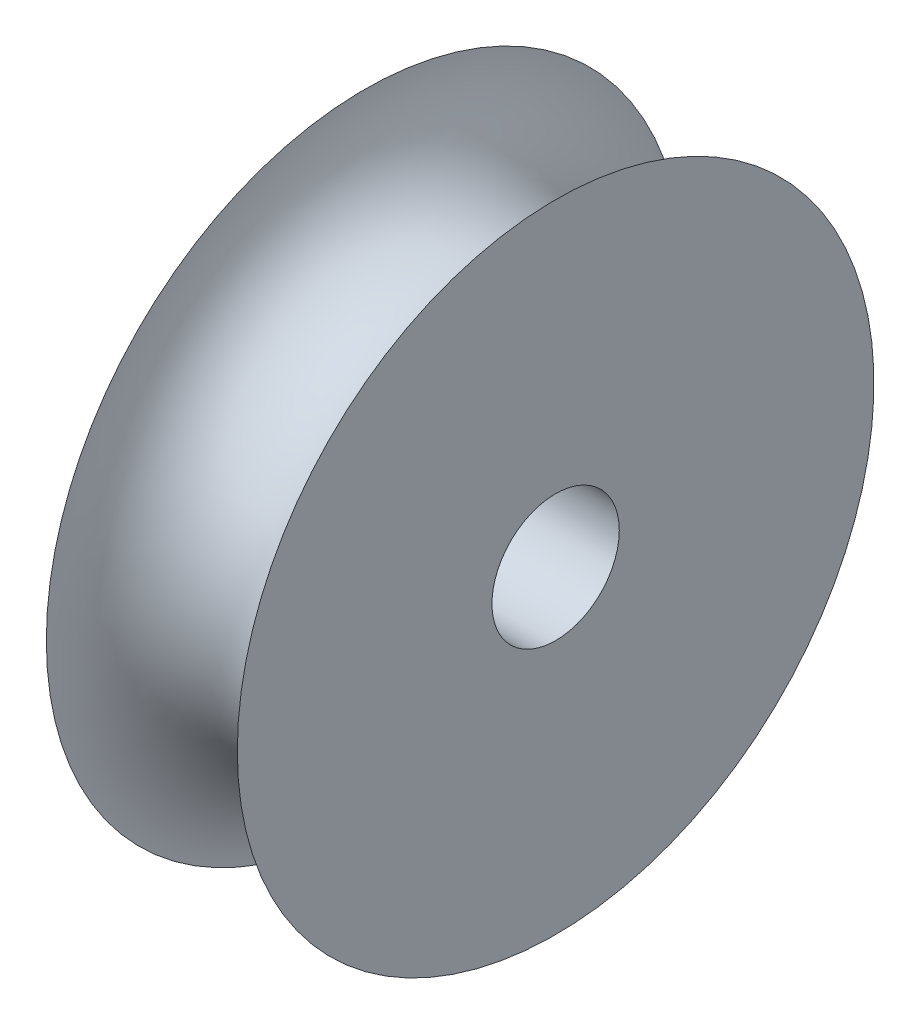
ISO-10303-21;
HEADER;
FILE_DESCRIPTION(('STEP AP214'),'2;1');
FILE_NAME('part.step','',(''),(''),'','','');
FILE_SCHEMA(('AUTOMOTIVE_DESIGN { 1 0 10303 214 1 1 1 1 }'));
ENDSEC;
DATA;
#1=APPLICATION_CONTEXT('core data for automotive mechanical design processes');
#2=APPLICATION_PROTOCOL_DEFINITION('international standard','automotive_design',2000,#1);
#3=PRODUCT_CONTEXT('',#1,'mechanical');
#4=PRODUCT('Part','Part','',(#3));
#5=PRODUCT_RELATED_PRODUCT_CATEGORY('part','',(#4));
#6=PRODUCT_DEFINITION_FORMATION('','',#4);
#7=PRODUCT_DEFINITION_CONTEXT('part definition',#1,'design');
#8=PRODUCT_DEFINITION('design','',#6,#7);
#9=PRODUCT_DEFINITION_SHAPE('','',#8);
#10=(LENGTH_UNIT() NAMED_UNIT(*) SI_UNIT(.MILLI.,.METRE.));
#11=(NAMED_UNIT(*) PLANE_ANGLE_UNIT() SI_UNIT($,.RADIAN.));
#12=(NAMED_UNIT(*) SI_UNIT($,.STERADIAN.) SOLID_ANGLE_UNIT());
#13=UNCERTAINTY_MEASURE_WITH_UNIT(LENGTH_MEASURE(1.E-05),#10,'distance_accuracy_value','');
#14=(GEOMETRIC_REPRESENTATION_CONTEXT(3) GLOBAL_UNCERTAINTY_ASSIGNED_CONTEXT((#13)) GLOBAL_UNIT_ASSIGNED_CONTEXT((#10,
#11,#12)) REPRESENTATION_CONTEXT('',''));
#15=CARTESIAN_POINT('',(0.,0.,0.));
#16=DIRECTION('',(0.,0.,1.));
#17=DIRECTION('',(1.,0.,0.));
#18=AXIS2_PLACEMENT_3D('',#15,#16,#17);
#19=CARTESIAN_POINT('',(4.7625,0.,0.));
#20=DIRECTION('',(-1.,0.,0.));
#21=DIRECTION('',(0.,0.,1.));
#22=AXIS2_PLACEMENT_3D('',#19,#20,#21);
#23=TOROIDAL_SURFACE('',#22,15.875,4.7625);
#24=CARTESIAN_POINT('',(0.,0.,0.));
#25=DIRECTION('',(-1.,0.,0.));
#26=DIRECTION('',(0.,0.,1.));
#27=AXIS2_PLACEMENT_3D('',#24,#25,#26);
#28=CIRCLE('',#27,15.875);
#29=CARTESIAN_POINT('',(0.,0.,15.875));
#30=VERTEX_POINT('',#29);
#31=EDGE_CURVE('E10',#30,#30,#28,.T.);
#32=ORIENTED_EDGE('',*,*,#31,.F.);
#33=EDGE_LOOP('',(#32));
#34=FACE_BOUND('',#33,.T.);
#35=CARTESIAN_POINT('',(9.525,0.,0.));
#36=DIRECTION('',(-1.,0.,0.));
#37=DIRECTION('',(0.,0.,1.));
#38=AXIS2_PLACEMENT_3D('',#35,#36,#37);
#39=CIRCLE('',#38,15.875);
#40=CARTESIAN_POINT('',(9.525,0.,15.875));
#41=VERTEX_POINT('',#40);
#42=EDGE_CURVE('E38',#41,#41,#39,.T.);
#43=ORIENTED_EDGE('',*,*,#42,.T.);
#44=EDGE_LOOP('',(#43));
#45=FACE_BOUND('',#44,.T.);
#46=ADVANCED_FACE('F32',(#34,#45),#23,.F.);
#47=CARTESIAN_POINT('',(0.,15.875,0.));
#48=DIRECTION('',(1.,0.,0.));
#49=DIRECTION('',(0.,0.,-1.));
#50=AXIS2_PLACEMENT_3D('',#47,#48,#49);
#51=PLANE('',#50);
#52=CARTESIAN_POINT('',(0.,0.,0.));
#53=DIRECTION('',(1.,0.,0.));
#54=DIRECTION('',(0.,0.,-1.));
#55=AXIS2_PLACEMENT_3D('',#52,#53,#54);
#56=CIRCLE('',#55,3.175);
#57=CARTESIAN_POINT('',(0.,0.,-3.175));
#58=VERTEX_POINT('',#57);
#59=EDGE_CURVE('E42',#58,#58,#56,.T.);
#60=ORIENTED_EDGE('',*,*,#59,.T.);
#61=EDGE_LOOP('',(#60));
#62=FACE_BOUND('',#61,.T.);
#63=ORIENTED_EDGE('',*,*,#31,.T.);
#64=EDGE_LOOP('',(#63));
#65=FACE_BOUND('',#64,.T.);
#66=ADVANCED_FACE('F57',(#62,#65),#51,.F.);
#67=CARTESIAN_POINT('',(9.525,0.,0.));
#68=DIRECTION('',(-1.,0.,0.));
#69=DIRECTION('',(0.,0.,1.));
#70=AXIS2_PLACEMENT_3D('',#67,#68,#69);
#71=PLANE('',#70);
#72=CARTESIAN_POINT('',(9.525,0.,0.));
#73=DIRECTION('',(1.,0.,0.));
#74=DIRECTION('',(0.,0.,-1.));
#75=AXIS2_PLACEMENT_3D('',#72,#73,#74);
#76=CIRCLE('',#75,3.175);
#77=CARTESIAN_POINT('',(9.525,0.,-3.175));
#78=VERTEX_POINT('',#77);
#79=EDGE_CURVE('E46',#78,#78,#76,.T.);
#80=ORIENTED_EDGE('',*,*,#79,.F.);
#81=EDGE_LOOP('',(#80));
#82=FACE_BOUND('',#81,.T.);
#83=ORIENTED_EDGE('',*,*,#42,.F.);
#84=EDGE_LOOP('',(#83));
#85=FACE_BOUND('',#84,.T.);
#86=ADVANCED_FACE('F54',(#82,#85),#71,.F.);
#87=CARTESIAN_POINT('',(0.,0.,0.));
#88=DIRECTION('',(1.,0.,0.));
#89=DIRECTION('',(0.,0.,-1.));
#90=AXIS2_PLACEMENT_3D('',#87,#88,#89);
#91=CYLINDRICAL_SURFACE('',#90,3.175);
#92=ORIENTED_EDGE('',*,*,#59,.F.);
#93=EDGE_LOOP('',(#92));
#94=FACE_BOUND('',#93,.T.);
#95=ORIENTED_EDGE('',*,*,#79,.T.);
#96=EDGE_LOOP('',(#95));
#97=FACE_BOUND('',#96,.T.);
#98=ADVANCED_FACE('F52',(#94,#97),#91,.F.);
#99=CLOSED_SHELL('',(#46,#66,#86,#98));
#100=MANIFOLD_SOLID_BREP('B2',#99);
#101=ADVANCED_BREP_SHAPE_REPRESENTATION('',(#18,#100),#14);
#102=SHAPE_DEFINITION_REPRESENTATION(#9,#101);
ENDSEC;
END-ISO-10303-21;
